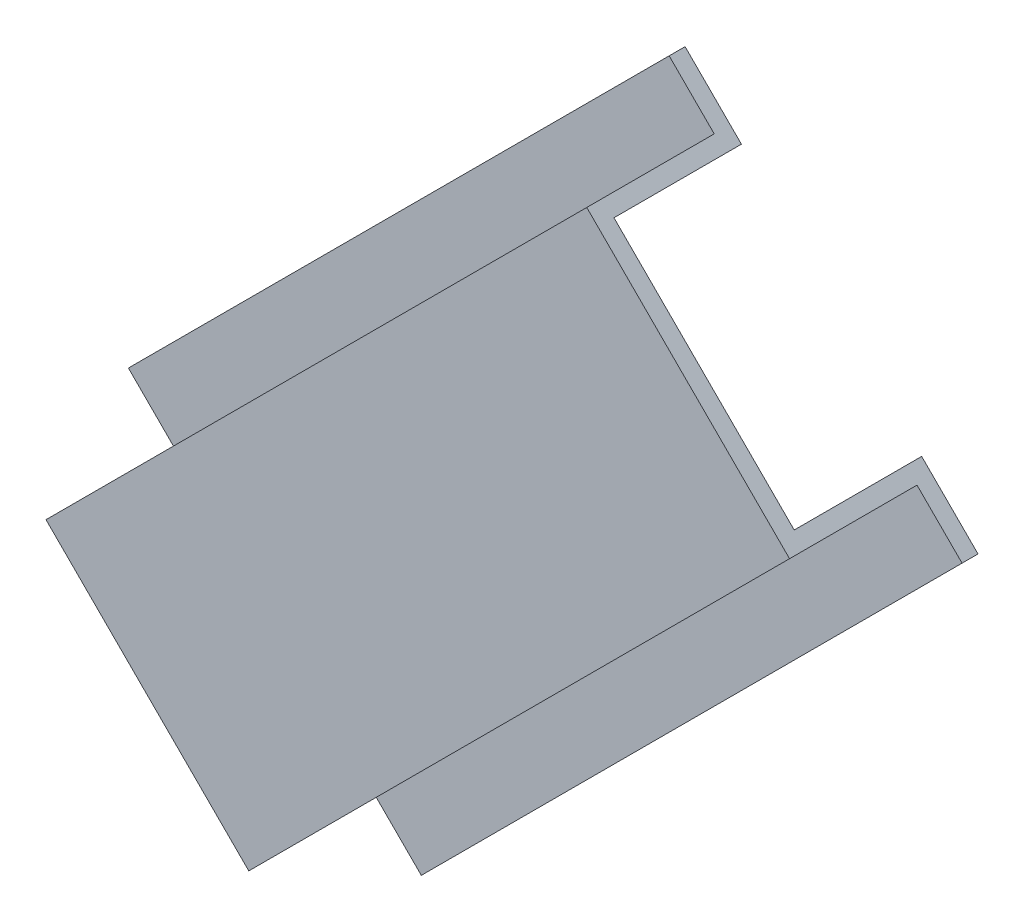
ISO-10303-21;
HEADER;
FILE_DESCRIPTION(('STEP AP214'),'2;1');
FILE_NAME('part.step','',(''),(''),'','','');
FILE_SCHEMA(('AUTOMOTIVE_DESIGN { 1 0 10303 214 1 1 1 1 }'));
ENDSEC;
DATA;
#1=APPLICATION_CONTEXT('core data for automotive mechanical design processes');
#2=APPLICATION_PROTOCOL_DEFINITION('international standard','automotive_design',2000,#1);
#3=PRODUCT_CONTEXT('',#1,'mechanical');
#4=PRODUCT('Part','Part','',(#3));
#5=PRODUCT_RELATED_PRODUCT_CATEGORY('part','',(#4));
#6=PRODUCT_DEFINITION_FORMATION('','',#4);
#7=PRODUCT_DEFINITION_CONTEXT('part definition',#1,'design');
#8=PRODUCT_DEFINITION('design','',#6,#7);
#9=PRODUCT_DEFINITION_SHAPE('','',#8);
#10=(LENGTH_UNIT() NAMED_UNIT(*) SI_UNIT(.MILLI.,.METRE.));
#11=(NAMED_UNIT(*) PLANE_ANGLE_UNIT() SI_UNIT($,.RADIAN.));
#12=(NAMED_UNIT(*) SI_UNIT($,.STERADIAN.) SOLID_ANGLE_UNIT());
#13=UNCERTAINTY_MEASURE_WITH_UNIT(LENGTH_MEASURE(1.E-05),#10,'distance_accuracy_value','');
#14=(GEOMETRIC_REPRESENTATION_CONTEXT(3) GLOBAL_UNCERTAINTY_ASSIGNED_CONTEXT((#13)) GLOBAL_UNIT_ASSIGNED_CONTEXT((#10,
#11,#12)) REPRESENTATION_CONTEXT('',''));
#15=CARTESIAN_POINT('',(0.,0.,0.));
#16=DIRECTION('',(0.,0.,1.));
#17=DIRECTION('',(1.,0.,0.));
#18=AXIS2_PLACEMENT_3D('',#15,#16,#17);
#19=CARTESIAN_POINT('',(71.8420489685533,35.9210244842773,0.));
#20=DIRECTION('',(0.,0.,-1.));
#21=DIRECTION('',(-1.,0.,0.));
#22=AXIS2_PLACEMENT_3D('',#19,#20,#21);
#23=PLANE('',#22);
#24=DIRECTION('',(0.707106781186551,-0.707106781186544,0.));
#25=VECTOR('',#24,1.);
#26=CARTESIAN_POINT('',(-35.921024484276,-71.8420489685532,0.));
#27=LINE('',#26,#25);
#28=CARTESIAN_POINT('',(-35.921024484276,-71.8420489685532,0.));
#29=VERTEX_POINT('',#28);
#30=CARTESIAN_POINT('',(-24.6957043329395,-83.0673691198896,0.));
#31=VERTEX_POINT('',#30);
#32=EDGE_CURVE('E155',#29,#31,#27,.T.);
#33=ORIENTED_EDGE('',*,*,#32,.F.);
#34=DIRECTION('',(-0.707106781186544,-0.707106781186551,0.));
#35=VECTOR('',#34,1.);
#36=CARTESIAN_POINT('',(71.8420489685533,35.9210244842773,0.));
#37=LINE('',#36,#35);
#38=CARTESIAN_POINT('',(71.8420489685533,35.9210244842773,0.));
#39=VERTEX_POINT('',#38);
#40=EDGE_CURVE('E11',#39,#29,#37,.T.);
#41=ORIENTED_EDGE('',*,*,#40,.F.);
#42=DIRECTION('',(0.707106781186551,-0.707106781186544,0.));
#43=VECTOR('',#42,1.);
#44=CARTESIAN_POINT('',(71.8420489685533,35.9210244842773,0.));
#45=LINE('',#44,#43);
#46=CARTESIAN_POINT('',(83.0673691198898,24.6957043329409,0.));
#47=VERTEX_POINT('',#46);
#48=EDGE_CURVE('E187',#39,#47,#45,.T.);
#49=ORIENTED_EDGE('',*,*,#48,.T.);
#50=DIRECTION('',(-0.707106781186544,-0.707106781186551,0.));
#51=VECTOR('',#50,1.);
#52=CARTESIAN_POINT('',(83.0673691198898,24.6957043329409,0.));
#53=LINE('',#52,#51);
#54=EDGE_CURVE('E37',#47,#31,#53,.T.);
#55=ORIENTED_EDGE('',*,*,#54,.T.);
#56=EDGE_LOOP('',(#33,#41,#49,#55));
#57=FACE_BOUND('',#56,.T.);
#58=ADVANCED_FACE('F34',(#57),#23,.T.);
#59=CARTESIAN_POINT('',(71.8420489685533,35.9210244842773,0.));
#60=DIRECTION('',(-0.707106781186551,0.707106781186544,0.));
#61=DIRECTION('',(-0.707106781186544,-0.707106781186551,0.));
#62=AXIS2_PLACEMENT_3D('',#59,#60,#61);
#63=PLANE('',#62);
#64=DIRECTION('',(0.,0.,-1.));
#65=VECTOR('',#64,1.);
#66=CARTESIAN_POINT('',(-35.921024484276,-71.8420489685532,0.));
#67=LINE('',#66,#65);
#68=CARTESIAN_POINT('',(-35.921024484276,-71.8420489685532,25.4));
#69=VERTEX_POINT('',#68);
#70=EDGE_CURVE('E185',#69,#29,#67,.T.);
#71=ORIENTED_EDGE('',*,*,#70,.F.);
#72=DIRECTION('',(-0.707106781186544,-0.707106781186551,0.));
#73=VECTOR('',#72,1.);
#74=CARTESIAN_POINT('',(71.8420489685533,35.9210244842773,25.4));
#75=LINE('',#74,#73);
#76=CARTESIAN_POINT('',(71.8420489685533,35.9210244842773,25.4));
#77=VERTEX_POINT('',#76);
#78=EDGE_CURVE('E43',#77,#69,#75,.T.);
#79=ORIENTED_EDGE('',*,*,#78,.F.);
#80=DIRECTION('',(0.,0.,-1.));
#81=VECTOR('',#80,1.);
#82=CARTESIAN_POINT('',(71.8420489685533,35.9210244842773,0.));
#83=LINE('',#82,#81);
#84=EDGE_CURVE('E145',#77,#39,#83,.T.);
#85=ORIENTED_EDGE('',*,*,#84,.T.);
#86=ORIENTED_EDGE('',*,*,#40,.T.);
#87=EDGE_LOOP('',(#71,#79,#85,#86));
#88=FACE_BOUND('',#87,.T.);
#89=ADVANCED_FACE('F207',(#88),#63,.T.);
#90=CARTESIAN_POINT('',(71.8420489685533,35.9210244842773,25.4));
#91=DIRECTION('',(0.,0.,-1.));
#92=DIRECTION('',(-1.,0.,0.));
#93=AXIS2_PLACEMENT_3D('',#90,#91,#92);
#94=PLANE('',#93);
#95=DIRECTION('',(0.707106781186551,-0.707106781186544,0.));
#96=VECTOR('',#95,1.);
#97=CARTESIAN_POINT('',(-35.921024484276,-71.8420489685532,25.4));
#98=LINE('',#97,#96);
#99=CARTESIAN_POINT('',(-71.8420489685528,-35.9210244842768,25.4));
#100=VERTEX_POINT('',#99);
#101=EDGE_CURVE('E132',#100,#69,#98,.T.);
#102=ORIENTED_EDGE('',*,*,#101,.F.);
#103=DIRECTION('',(-0.707106781186544,-0.707106781186551,0.));
#104=VECTOR('',#103,1.);
#105=CARTESIAN_POINT('',(35.9210244842765,71.8420489685537,25.4));
#106=LINE('',#105,#104);
#107=CARTESIAN_POINT('',(35.9210244842765,71.8420489685537,25.4));
#108=VERTEX_POINT('',#107);
#109=EDGE_CURVE('E127',#108,#100,#106,.T.);
#110=ORIENTED_EDGE('',*,*,#109,.F.);
#111=DIRECTION('',(0.707106781186551,-0.707106781186544,0.));
#112=VECTOR('',#111,1.);
#113=CARTESIAN_POINT('',(71.8420489685533,35.9210244842773,25.4));
#114=LINE('',#113,#112);
#115=EDGE_CURVE('E130',#108,#77,#114,.T.);
#116=ORIENTED_EDGE('',*,*,#115,.T.);
#117=ORIENTED_EDGE('',*,*,#78,.T.);
#118=EDGE_LOOP('',(#102,#110,#116,#117));
#119=FACE_BOUND('',#118,.T.);
#120=ADVANCED_FACE('F129',(#119),#94,.T.);
#121=CARTESIAN_POINT('',(35.9210244842765,71.8420489685537,0.));
#122=DIRECTION('',(0.707106781186551,-0.707106781186544,0.));
#123=DIRECTION('',(0.707106781186544,0.707106781186551,0.));
#124=AXIS2_PLACEMENT_3D('',#121,#122,#123);
#125=PLANE('',#124);
#126=DIRECTION('',(0.,0.,1.));
#127=VECTOR('',#126,1.);
#128=CARTESIAN_POINT('',(-71.8420489685528,-35.9210244842768,0.));
#129=LINE('',#128,#127);
#130=CARTESIAN_POINT('',(-71.8420489685528,-35.9210244842768,0.));
#131=VERTEX_POINT('',#130);
#132=EDGE_CURVE('E182',#131,#100,#129,.T.);
#133=ORIENTED_EDGE('',*,*,#132,.F.);
#134=DIRECTION('',(-0.707106781186544,-0.707106781186551,0.));
#135=VECTOR('',#134,1.);
#136=CARTESIAN_POINT('',(35.9210244842765,71.8420489685537,0.));
#137=LINE('',#136,#135);
#138=CARTESIAN_POINT('',(35.9210244842765,71.8420489685537,0.));
#139=VERTEX_POINT('',#138);
#140=EDGE_CURVE('E137',#139,#131,#137,.T.);
#141=ORIENTED_EDGE('',*,*,#140,.F.);
#142=DIRECTION('',(0.,0.,1.));
#143=VECTOR('',#142,1.);
#144=CARTESIAN_POINT('',(35.9210244842765,71.8420489685537,0.));
#145=LINE('',#144,#143);
#146=EDGE_CURVE('E143',#139,#108,#145,.T.);
#147=ORIENTED_EDGE('',*,*,#146,.T.);
#148=ORIENTED_EDGE('',*,*,#109,.T.);
#149=EDGE_LOOP('',(#133,#141,#147,#148));
#150=FACE_BOUND('',#149,.T.);
#151=ADVANCED_FACE('F147',(#150),#125,.T.);
#152=CARTESIAN_POINT('',(35.9210244842765,71.8420489685537,0.));
#153=DIRECTION('',(0.,0.,-1.));
#154=DIRECTION('',(-1.,0.,0.));
#155=AXIS2_PLACEMENT_3D('',#152,#153,#154);
#156=PLANE('',#155);
#157=DIRECTION('',(0.707106781186551,-0.707106781186543,0.));
#158=VECTOR('',#157,1.);
#159=CARTESIAN_POINT('',(-71.8420489685528,-35.9210244842768,0.));
#160=LINE('',#159,#158);
#161=CARTESIAN_POINT('',(-83.0673691198893,-24.6957043329404,0.));
#162=VERTEX_POINT('',#161);
#163=EDGE_CURVE('E179',#162,#131,#160,.T.);
#164=ORIENTED_EDGE('',*,*,#163,.F.);
#165=DIRECTION('',(-0.707106781186544,-0.707106781186551,0.));
#166=VECTOR('',#165,1.);
#167=CARTESIAN_POINT('',(24.6957043329399,83.06736911989,0.));
#168=LINE('',#167,#166);
#169=CARTESIAN_POINT('',(24.6957043329399,83.06736911989,0.));
#170=VERTEX_POINT('',#169);
#171=EDGE_CURVE('E191',#170,#162,#168,.T.);
#172=ORIENTED_EDGE('',*,*,#171,.F.);
#173=DIRECTION('',(0.707106781186551,-0.707106781186543,0.));
#174=VECTOR('',#173,1.);
#175=CARTESIAN_POINT('',(35.9210244842765,71.8420489685537,0.));
#176=LINE('',#175,#174);
#177=EDGE_CURVE('E148',#170,#139,#176,.T.);
#178=ORIENTED_EDGE('',*,*,#177,.T.);
#179=ORIENTED_EDGE('',*,*,#140,.T.);
#180=EDGE_LOOP('',(#164,#172,#178,#179));
#181=FACE_BOUND('',#180,.T.);
#182=ADVANCED_FACE('F220',(#181),#156,.T.);
#183=CARTESIAN_POINT('',(24.6957043329399,83.06736911989,0.));
#184=DIRECTION('',(-0.707106781186551,0.707106781186544,0.));
#185=DIRECTION('',(-0.707106781186544,-0.707106781186551,0.));
#186=AXIS2_PLACEMENT_3D('',#183,#184,#185);
#187=PLANE('',#186);
#188=DIRECTION('',(0.,0.,-1.));
#189=VECTOR('',#188,1.);
#190=CARTESIAN_POINT('',(-83.0673691198893,-24.6957043329404,0.));
#191=LINE('',#190,#189);
#192=CARTESIAN_POINT('',(-83.0673691198893,-24.6957043329404,3.175));
#193=VERTEX_POINT('',#192);
#194=EDGE_CURVE('E176',#193,#162,#191,.T.);
#195=ORIENTED_EDGE('',*,*,#194,.F.);
#196=DIRECTION('',(-0.707106781186544,-0.707106781186551,0.));
#197=VECTOR('',#196,1.);
#198=CARTESIAN_POINT('',(24.6957043329399,83.06736911989,3.175));
#199=LINE('',#198,#197);
#200=CARTESIAN_POINT('',(24.6957043329399,83.06736911989,3.175));
#201=VERTEX_POINT('',#200);
#202=EDGE_CURVE('E193',#201,#193,#199,.T.);
#203=ORIENTED_EDGE('',*,*,#202,.F.);
#204=DIRECTION('',(0.,0.,-1.));
#205=VECTOR('',#204,1.);
#206=CARTESIAN_POINT('',(24.6957043329399,83.06736911989,0.));
#207=LINE('',#206,#205);
#208=EDGE_CURVE('E150',#201,#170,#207,.T.);
#209=ORIENTED_EDGE('',*,*,#208,.T.);
#210=ORIENTED_EDGE('',*,*,#171,.T.);
#211=EDGE_LOOP('',(#195,#203,#209,#210));
#212=FACE_BOUND('',#211,.T.);
#213=ADVANCED_FACE('F223',(#212),#187,.T.);
#214=CARTESIAN_POINT('',(24.6957043329399,83.06736911989,3.175));
#215=DIRECTION('',(0.,0.,1.));
#216=DIRECTION('',(1.,0.,0.));
#217=AXIS2_PLACEMENT_3D('',#214,#215,#216);
#218=PLANE('',#217);
#219=DIRECTION('',(-0.707106781186551,0.707106781186544,0.));
#220=VECTOR('',#219,1.);
#221=CARTESIAN_POINT('',(-83.0673691198893,-24.6957043329404,3.175));
#222=LINE('',#221,#220);
#223=CARTESIAN_POINT('',(-74.0871129988201,-33.6759604540095,3.175));
#224=VERTEX_POINT('',#223);
#225=EDGE_CURVE('E173',#224,#193,#222,.T.);
#226=ORIENTED_EDGE('',*,*,#225,.F.);
#227=DIRECTION('',(-0.707106781186544,-0.707106781186551,0.));
#228=VECTOR('',#227,1.);
#229=CARTESIAN_POINT('',(33.6759604540091,74.0871129988209,3.175));
#230=LINE('',#229,#228);
#231=CARTESIAN_POINT('',(33.6759604540091,74.0871129988209,3.175));
#232=VERTEX_POINT('',#231);
#233=EDGE_CURVE('E195',#232,#224,#230,.T.);
#234=ORIENTED_EDGE('',*,*,#233,.F.);
#235=DIRECTION('',(-0.707106781186551,0.707106781186544,0.));
#236=VECTOR('',#235,1.);
#237=CARTESIAN_POINT('',(24.6957043329399,83.06736911989,3.175));
#238=LINE('',#237,#236);
#239=EDGE_CURVE('E349',#232,#201,#238,.T.);
#240=ORIENTED_EDGE('',*,*,#239,.T.);
#241=ORIENTED_EDGE('',*,*,#202,.T.);
#242=EDGE_LOOP('',(#226,#234,#240,#241));
#243=FACE_BOUND('',#242,.T.);
#244=ADVANCED_FACE('F227',(#243),#218,.T.);
#245=CARTESIAN_POINT('',(33.6759604540091,74.0871129988209,3.175));
#246=DIRECTION('',(-0.707106781186551,0.707106781186544,0.));
#247=DIRECTION('',(-0.707106781186544,-0.707106781186551,0.));
#248=AXIS2_PLACEMENT_3D('',#245,#246,#247);
#249=PLANE('',#248);
#250=DIRECTION('',(0.,0.,-1.));
#251=VECTOR('',#250,1.);
#252=CARTESIAN_POINT('',(-74.0871129988201,-33.6759604540095,3.175));
#253=LINE('',#252,#251);
#254=CARTESIAN_POINT('',(-74.0871129988201,-33.6759604540095,28.575));
#255=VERTEX_POINT('',#254);
#256=EDGE_CURVE('E170',#255,#224,#253,.T.);
#257=ORIENTED_EDGE('',*,*,#256,.F.);
#258=DIRECTION('',(-0.707106781186544,-0.707106781186551,0.));
#259=VECTOR('',#258,1.);
#260=CARTESIAN_POINT('',(33.6759604540091,74.0871129988209,28.575));
#261=LINE('',#260,#259);
#262=CARTESIAN_POINT('',(33.6759604540091,74.0871129988209,28.575));
#263=VERTEX_POINT('',#262);
#264=EDGE_CURVE('E197',#263,#255,#261,.T.);
#265=ORIENTED_EDGE('',*,*,#264,.F.);
#266=DIRECTION('',(0.,0.,-1.));
#267=VECTOR('',#266,1.);
#268=CARTESIAN_POINT('',(33.6759604540091,74.0871129988209,3.175));
#269=LINE('',#268,#267);
#270=EDGE_CURVE('E353',#263,#232,#269,.T.);
#271=ORIENTED_EDGE('',*,*,#270,.T.);
#272=ORIENTED_EDGE('',*,*,#233,.T.);
#273=EDGE_LOOP('',(#257,#265,#271,#272));
#274=FACE_BOUND('',#273,.T.);
#275=ADVANCED_FACE('F231',(#274),#249,.T.);
#276=CARTESIAN_POINT('',(74.0871129988206,33.67596045401,28.575));
#277=DIRECTION('',(0.,0.,1.));
#278=DIRECTION('',(1.,0.,0.));
#279=AXIS2_PLACEMENT_3D('',#276,#277,#278);
#280=PLANE('',#279);
#281=DIRECTION('',(-0.707106781186551,0.707106781186543,0.));
#282=VECTOR('',#281,1.);
#283=CARTESIAN_POINT('',(-33.6759604540087,-74.0871129988205,28.575));
#284=LINE('',#283,#282);
#285=CARTESIAN_POINT('',(-33.6759604540087,-74.0871129988205,28.575));
#286=VERTEX_POINT('',#285);
#287=EDGE_CURVE('E167',#286,#255,#284,.T.);
#288=ORIENTED_EDGE('',*,*,#287,.F.);
#289=DIRECTION('',(-0.707106781186544,-0.707106781186551,0.));
#290=VECTOR('',#289,1.);
#291=CARTESIAN_POINT('',(74.0871129988206,33.67596045401,28.575));
#292=LINE('',#291,#290);
#293=CARTESIAN_POINT('',(74.0871129988206,33.67596045401,28.575));
#294=VERTEX_POINT('',#293);
#295=EDGE_CURVE('E199',#294,#286,#292,.T.);
#296=ORIENTED_EDGE('',*,*,#295,.F.);
#297=DIRECTION('',(-0.707106781186551,0.707106781186543,0.));
#298=VECTOR('',#297,1.);
#299=CARTESIAN_POINT('',(74.0871129988206,33.67596045401,28.575));
#300=LINE('',#299,#298);
#301=EDGE_CURVE('E342',#294,#263,#300,.T.);
#302=ORIENTED_EDGE('',*,*,#301,.T.);
#303=ORIENTED_EDGE('',*,*,#264,.T.);
#304=EDGE_LOOP('',(#288,#296,#302,#303));
#305=FACE_BOUND('',#304,.T.);
#306=ADVANCED_FACE('F235',(#305),#280,.T.);
#307=CARTESIAN_POINT('',(74.0871129988206,33.67596045401,3.175));
#308=DIRECTION('',(0.707106781186551,-0.707106781186544,0.));
#309=DIRECTION('',(0.707106781186544,0.707106781186551,0.));
#310=AXIS2_PLACEMENT_3D('',#307,#308,#309);
#311=PLANE('',#310);
#312=DIRECTION('',(0.,0.,1.));
#313=VECTOR('',#312,1.);
#314=CARTESIAN_POINT('',(-33.6759604540087,-74.0871129988205,3.175));
#315=LINE('',#314,#313);
#316=CARTESIAN_POINT('',(-33.6759604540087,-74.0871129988205,3.175));
#317=VERTEX_POINT('',#316);
#318=EDGE_CURVE('E164',#317,#286,#315,.T.);
#319=ORIENTED_EDGE('',*,*,#318,.F.);
#320=DIRECTION('',(-0.707106781186544,-0.707106781186551,0.));
#321=VECTOR('',#320,1.);
#322=CARTESIAN_POINT('',(74.0871129988206,33.67596045401,3.175));
#323=LINE('',#322,#321);
#324=CARTESIAN_POINT('',(74.0871129988206,33.67596045401,3.175));
#325=VERTEX_POINT('',#324);
#326=EDGE_CURVE('E201',#325,#317,#323,.T.);
#327=ORIENTED_EDGE('',*,*,#326,.F.);
#328=DIRECTION('',(0.,0.,1.));
#329=VECTOR('',#328,1.);
#330=CARTESIAN_POINT('',(74.0871129988206,33.67596045401,3.175));
#331=LINE('',#330,#329);
#332=EDGE_CURVE('E338',#325,#294,#331,.T.);
#333=ORIENTED_EDGE('',*,*,#332,.T.);
#334=ORIENTED_EDGE('',*,*,#295,.T.);
#335=EDGE_LOOP('',(#319,#327,#333,#334));
#336=FACE_BOUND('',#335,.T.);
#337=ADVANCED_FACE('F239',(#336),#311,.T.);
#338=CARTESIAN_POINT('',(83.0673691198898,24.6957043329409,3.175));
#339=DIRECTION('',(0.,0.,1.));
#340=DIRECTION('',(1.,0.,0.));
#341=AXIS2_PLACEMENT_3D('',#338,#339,#340);
#342=PLANE('',#341);
#343=DIRECTION('',(-0.707106781186551,0.707106781186544,0.));
#344=VECTOR('',#343,1.);
#345=CARTESIAN_POINT('',(-24.6957043329395,-83.0673691198896,3.175));
#346=LINE('',#345,#344);
#347=CARTESIAN_POINT('',(-24.6957043329395,-83.0673691198896,3.175));
#348=VERTEX_POINT('',#347);
#349=EDGE_CURVE('E161',#348,#317,#346,.T.);
#350=ORIENTED_EDGE('',*,*,#349,.F.);
#351=DIRECTION('',(-0.707106781186544,-0.707106781186551,0.));
#352=VECTOR('',#351,1.);
#353=CARTESIAN_POINT('',(83.0673691198898,24.6957043329409,3.175));
#354=LINE('',#353,#352);
#355=CARTESIAN_POINT('',(83.0673691198898,24.6957043329409,3.175));
#356=VERTEX_POINT('',#355);
#357=EDGE_CURVE('E202',#356,#348,#354,.T.);
#358=ORIENTED_EDGE('',*,*,#357,.F.);
#359=DIRECTION('',(-0.707106781186551,0.707106781186544,0.));
#360=VECTOR('',#359,1.);
#361=CARTESIAN_POINT('',(83.0673691198898,24.6957043329409,3.175));
#362=LINE('',#361,#360);
#363=EDGE_CURVE('E359',#356,#325,#362,.T.);
#364=ORIENTED_EDGE('',*,*,#363,.T.);
#365=ORIENTED_EDGE('',*,*,#326,.T.);
#366=EDGE_LOOP('',(#350,#358,#364,#365));
#367=FACE_BOUND('',#366,.T.);
#368=ADVANCED_FACE('F243',(#367),#342,.T.);
#369=CARTESIAN_POINT('',(83.0673691198898,24.6957043329409,0.));
#370=DIRECTION('',(0.707106781186551,-0.707106781186544,0.));
#371=DIRECTION('',(0.707106781186544,0.707106781186551,0.));
#372=AXIS2_PLACEMENT_3D('',#369,#370,#371);
#373=PLANE('',#372);
#374=DIRECTION('',(0.,0.,1.));
#375=VECTOR('',#374,1.);
#376=CARTESIAN_POINT('',(-24.6957043329395,-83.0673691198896,0.));
#377=LINE('',#376,#375);
#378=EDGE_CURVE('E158',#31,#348,#377,.T.);
#379=ORIENTED_EDGE('',*,*,#378,.F.);
#380=ORIENTED_EDGE('',*,*,#54,.F.);
#381=DIRECTION('',(0.,0.,1.));
#382=VECTOR('',#381,1.);
#383=CARTESIAN_POINT('',(83.0673691198898,24.6957043329409,0.));
#384=LINE('',#383,#382);
#385=EDGE_CURVE('E361',#47,#356,#384,.T.);
#386=ORIENTED_EDGE('',*,*,#385,.T.);
#387=ORIENTED_EDGE('',*,*,#357,.T.);
#388=EDGE_LOOP('',(#379,#380,#386,#387));
#389=FACE_BOUND('',#388,.T.);
#390=ADVANCED_FACE('F204',(#389),#373,.T.);
#391=CARTESIAN_POINT('',(53.8815367264149,53.8815367264155,0.));
#392=DIRECTION('',(-0.707106781186544,-0.707106781186551,0.));
#393=DIRECTION('',(0.707106781186551,-0.707106781186544,0.));
#394=AXIS2_PLACEMENT_3D('',#391,#392,#393);
#395=PLANE('',#394);
#396=ORIENTED_EDGE('',*,*,#48,.F.);
#397=ORIENTED_EDGE('',*,*,#84,.F.);
#398=ORIENTED_EDGE('',*,*,#115,.F.);
#399=ORIENTED_EDGE('',*,*,#146,.F.);
#400=ORIENTED_EDGE('',*,*,#177,.F.);
#401=ORIENTED_EDGE('',*,*,#208,.F.);
#402=ORIENTED_EDGE('',*,*,#239,.F.);
#403=ORIENTED_EDGE('',*,*,#270,.F.);
#404=ORIENTED_EDGE('',*,*,#301,.F.);
#405=ORIENTED_EDGE('',*,*,#332,.F.);
#406=ORIENTED_EDGE('',*,*,#363,.F.);
#407=ORIENTED_EDGE('',*,*,#385,.F.);
#408=EDGE_LOOP('',(#396,#397,#398,#399,#400,#401,#402,#403,#404,#405,#406,#407));
#409=FACE_BOUND('',#408,.T.);
#410=ADVANCED_FACE('F141',(#409),#395,.F.);
#411=CARTESIAN_POINT('',(-53.8815367264144,-53.881536726415,0.));
#412=DIRECTION('',(-0.707106781186544,-0.707106781186551,0.));
#413=DIRECTION('',(0.707106781186551,-0.707106781186544,0.));
#414=AXIS2_PLACEMENT_3D('',#411,#412,#413);
#415=PLANE('',#414);
#416=ORIENTED_EDGE('',*,*,#32,.T.);
#417=ORIENTED_EDGE('',*,*,#378,.T.);
#418=ORIENTED_EDGE('',*,*,#349,.T.);
#419=ORIENTED_EDGE('',*,*,#318,.T.);
#420=ORIENTED_EDGE('',*,*,#287,.T.);
#421=ORIENTED_EDGE('',*,*,#256,.T.);
#422=ORIENTED_EDGE('',*,*,#225,.T.);
#423=ORIENTED_EDGE('',*,*,#194,.T.);
#424=ORIENTED_EDGE('',*,*,#163,.T.);
#425=ORIENTED_EDGE('',*,*,#132,.T.);
#426=ORIENTED_EDGE('',*,*,#101,.T.);
#427=ORIENTED_EDGE('',*,*,#70,.T.);
#428=EDGE_LOOP('',(#416,#417,#418,#419,#420,#421,#422,#423,#424,#425,#426,#427));
#429=FACE_BOUND('',#428,.T.);
#430=ADVANCED_FACE('F206',(#429),#415,.T.);
#431=CLOSED_SHELL('',(#58,#89,#120,#151,#182,#213,#244,#275,#306,#337,#368,#390,#410,#430));
#432=MANIFOLD_SOLID_BREP('B2',#431);
#433=ADVANCED_BREP_SHAPE_REPRESENTATION('',(#18,#432),#14);
#434=SHAPE_DEFINITION_REPRESENTATION(#9,#433);
ENDSEC;
END-ISO-10303-21;
